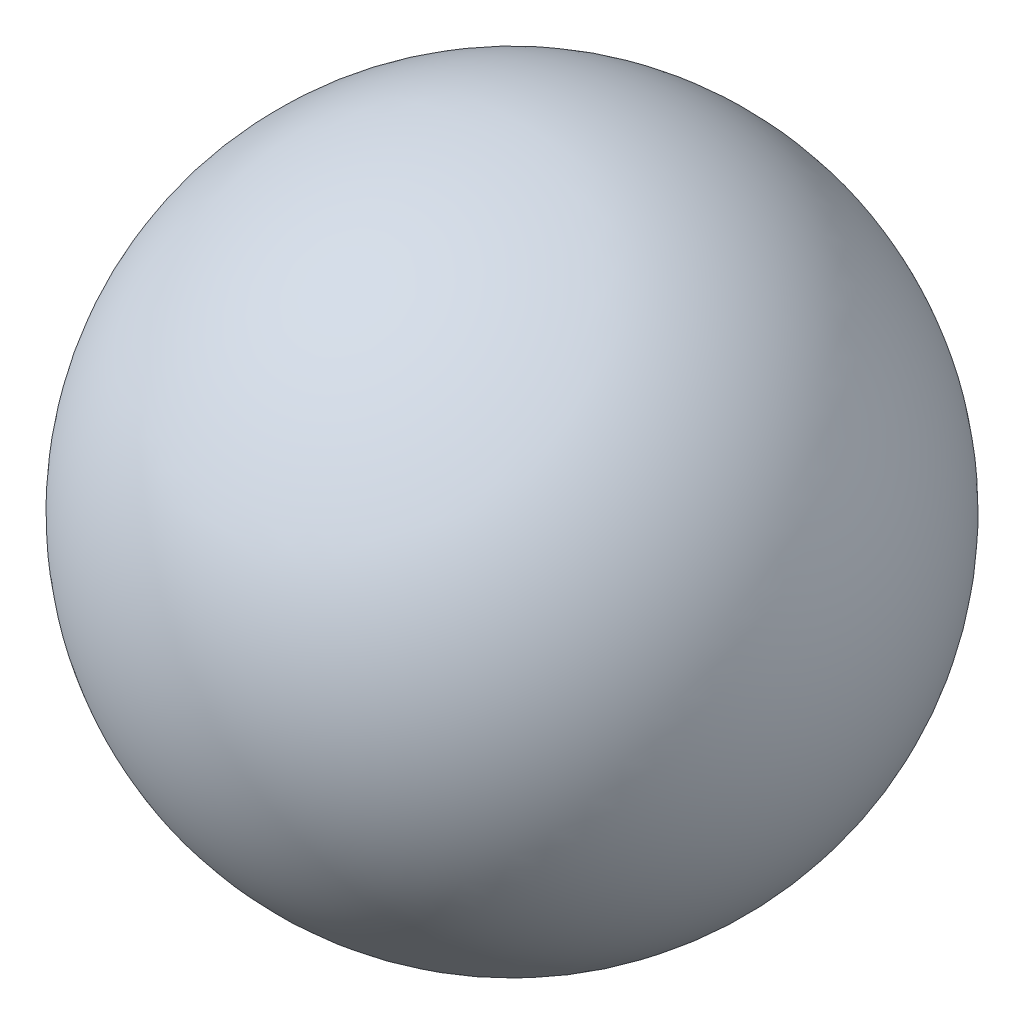
ISO-10303-21;
HEADER;
FILE_DESCRIPTION(('STEP AP214'),'2;1');
FILE_NAME('part.step','',(''),(''),'','','');
FILE_SCHEMA(('AUTOMOTIVE_DESIGN { 1 0 10303 214 1 1 1 1 }'));
ENDSEC;
DATA;
#1=APPLICATION_CONTEXT('core data for automotive mechanical design processes');
#2=APPLICATION_PROTOCOL_DEFINITION('international standard','automotive_design',2000,#1);
#3=PRODUCT_CONTEXT('',#1,'mechanical');
#4=PRODUCT('Part','Part','',(#3));
#5=PRODUCT_RELATED_PRODUCT_CATEGORY('part','',(#4));
#6=PRODUCT_DEFINITION_FORMATION('','',#4);
#7=PRODUCT_DEFINITION_CONTEXT('part definition',#1,'design');
#8=PRODUCT_DEFINITION('design','',#6,#7);
#9=PRODUCT_DEFINITION_SHAPE('','',#8);
#10=(LENGTH_UNIT() NAMED_UNIT(*) SI_UNIT(.MILLI.,.METRE.));
#11=(NAMED_UNIT(*) PLANE_ANGLE_UNIT() SI_UNIT($,.RADIAN.));
#12=(NAMED_UNIT(*) SI_UNIT($,.STERADIAN.) SOLID_ANGLE_UNIT());
#13=UNCERTAINTY_MEASURE_WITH_UNIT(LENGTH_MEASURE(1.E-05),#10,'distance_accuracy_value','');
#14=(GEOMETRIC_REPRESENTATION_CONTEXT(3) GLOBAL_UNCERTAINTY_ASSIGNED_CONTEXT((#13)) GLOBAL_UNIT_ASSIGNED_CONTEXT((#10,
#11,#12)) REPRESENTATION_CONTEXT('',''));
#15=CARTESIAN_POINT('',(0.,0.,0.));
#16=DIRECTION('',(0.,0.,1.));
#17=DIRECTION('',(1.,0.,0.));
#18=AXIS2_PLACEMENT_3D('',#15,#16,#17);
#19=CARTESIAN_POINT('',(-7.91857153504746,-3.,-1.13851870618628));
#20=DIRECTION('',(0.,0.,1.));
#21=DIRECTION('',(1.,0.,0.));
#22=AXIS2_PLACEMENT_3D('',#19,#20,#21);
#23=SPHERICAL_SURFACE('',#22,1.8);
#24=CARTESIAN_POINT('',(-7.91857153504746,-3.,0.66148129381372));
#25=VERTEX_POINT('',#24);
#26=VERTEX_LOOP('',#25);
#27=FACE_BOUND('',#26,.T.);
#28=ADVANCED_FACE('F12',(#27),#23,.T.);
#29=CLOSED_SHELL('',(#28));
#30=MANIFOLD_SOLID_BREP('B1',#29);
#31=ADVANCED_BREP_SHAPE_REPRESENTATION('',(#18,#30),#14);
#32=SHAPE_DEFINITION_REPRESENTATION(#9,#31);
ENDSEC;
END-ISO-10303-21;
